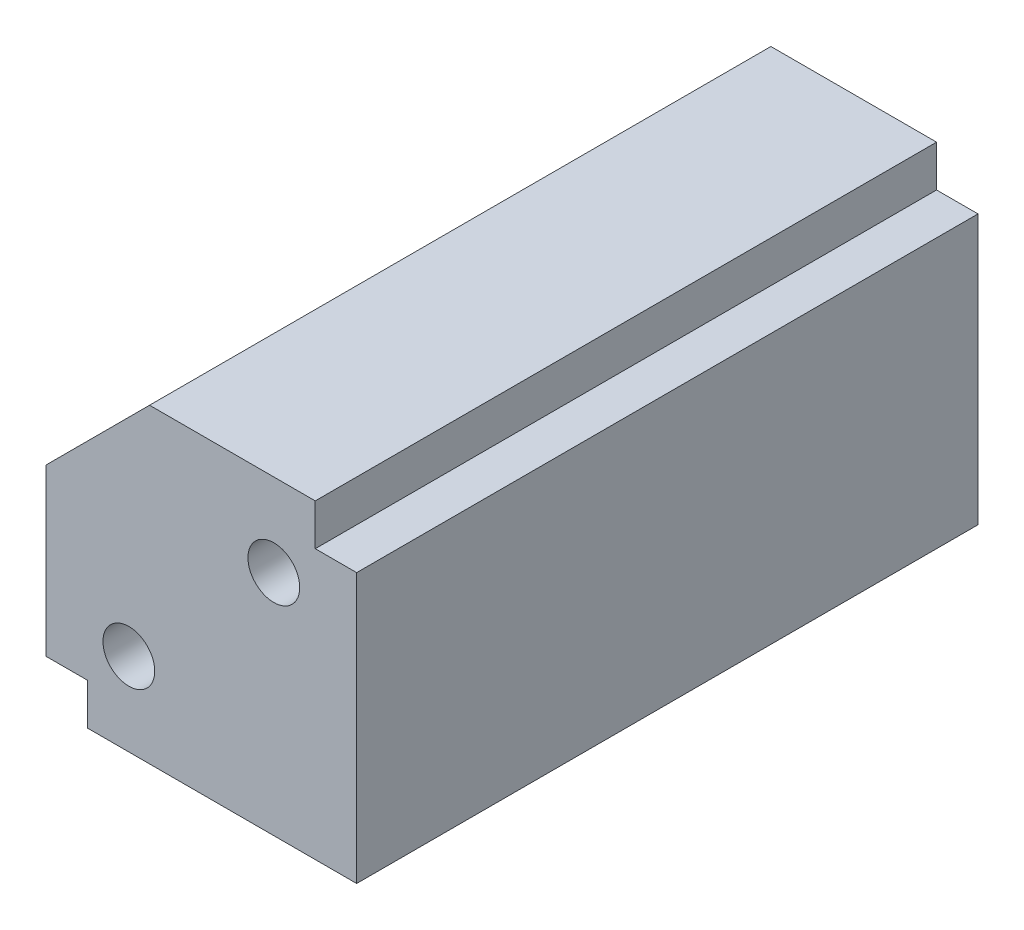
ISO-10303-21;
HEADER;
FILE_DESCRIPTION(('STEP AP214'),'2;1');
FILE_NAME('part.step','',(''),(''),'','','');
FILE_SCHEMA(('AUTOMOTIVE_DESIGN { 1 0 10303 214 1 1 1 1 }'));
ENDSEC;
DATA;
#1=APPLICATION_CONTEXT('core data for automotive mechanical design processes');
#2=APPLICATION_PROTOCOL_DEFINITION('international standard','automotive_design',2000,#1);
#3=PRODUCT_CONTEXT('',#1,'mechanical');
#4=PRODUCT('Part','Part','',(#3));
#5=PRODUCT_RELATED_PRODUCT_CATEGORY('part','',(#4));
#6=PRODUCT_DEFINITION_FORMATION('','',#4);
#7=PRODUCT_DEFINITION_CONTEXT('part definition',#1,'design');
#8=PRODUCT_DEFINITION('design','',#6,#7);
#9=PRODUCT_DEFINITION_SHAPE('','',#8);
#10=(LENGTH_UNIT() NAMED_UNIT(*) SI_UNIT(.MILLI.,.METRE.));
#11=(NAMED_UNIT(*) PLANE_ANGLE_UNIT() SI_UNIT($,.RADIAN.));
#12=(NAMED_UNIT(*) SI_UNIT($,.STERADIAN.) SOLID_ANGLE_UNIT());
#13=UNCERTAINTY_MEASURE_WITH_UNIT(LENGTH_MEASURE(1.E-05),#10,'distance_accuracy_value','');
#14=(GEOMETRIC_REPRESENTATION_CONTEXT(3) GLOBAL_UNCERTAINTY_ASSIGNED_CONTEXT((#13)) GLOBAL_UNIT_ASSIGNED_CONTEXT((#10,
#11,#12)) REPRESENTATION_CONTEXT('',''));
#15=CARTESIAN_POINT('',(0.,0.,0.));
#16=DIRECTION('',(0.,0.,1.));
#17=DIRECTION('',(1.,0.,0.));
#18=AXIS2_PLACEMENT_3D('',#15,#16,#17);
#19=CARTESIAN_POINT('',(-7.5,-7.5,30.));
#20=DIRECTION('',(1.,0.,0.));
#21=DIRECTION('',(0.,0.,-1.));
#22=AXIS2_PLACEMENT_3D('',#19,#20,#21);
#23=PLANE('',#22);
#24=DIRECTION('',(0.,-1.,0.));
#25=VECTOR('',#24,1.);
#26=CARTESIAN_POINT('',(-7.5,-7.5,0.));
#27=LINE('',#26,#25);
#28=CARTESIAN_POINT('',(-7.5,2.5,0.));
#29=VERTEX_POINT('',#28);
#30=CARTESIAN_POINT('',(-7.5,-5.5,0.));
#31=VERTEX_POINT('',#30);
#32=EDGE_CURVE('E146',#29,#31,#27,.T.);
#33=ORIENTED_EDGE('',*,*,#32,.T.);
#34=DIRECTION('',(0.,0.,-1.));
#35=VECTOR('',#34,1.);
#36=CARTESIAN_POINT('',(-7.5,-5.5,0.));
#37=LINE('',#36,#35);
#38=CARTESIAN_POINT('',(-7.5,-5.5,30.));
#39=VERTEX_POINT('',#38);
#40=EDGE_CURVE('E130',#39,#31,#37,.T.);
#41=ORIENTED_EDGE('',*,*,#40,.F.);
#42=DIRECTION('',(0.,-1.,0.));
#43=VECTOR('',#42,1.);
#44=CARTESIAN_POINT('',(-7.5,-7.5,30.));
#45=LINE('',#44,#43);
#46=CARTESIAN_POINT('',(-7.5,2.5,30.));
#47=VERTEX_POINT('',#46);
#48=EDGE_CURVE('E162',#47,#39,#45,.T.);
#49=ORIENTED_EDGE('',*,*,#48,.F.);
#50=DIRECTION('',(0.,0.,-1.));
#51=VECTOR('',#50,1.);
#52=CARTESIAN_POINT('',(-7.5,2.5,30.));
#53=LINE('',#52,#51);
#54=EDGE_CURVE('E166',#47,#29,#53,.T.);
#55=ORIENTED_EDGE('',*,*,#54,.T.);
#56=EDGE_LOOP('',(#33,#41,#49,#55));
#57=FACE_BOUND('',#56,.T.);
#58=ADVANCED_FACE('F40',(#57),#23,.F.);
#59=CARTESIAN_POINT('',(7.5,-7.5,30.));
#60=DIRECTION('',(0.,1.,0.));
#61=DIRECTION('',(-1.,0.,0.));
#62=AXIS2_PLACEMENT_3D('',#59,#60,#61);
#63=PLANE('',#62);
#64=DIRECTION('',(1.,0.,0.));
#65=VECTOR('',#64,1.);
#66=CARTESIAN_POINT('',(7.5,-7.5,30.));
#67=LINE('',#66,#65);
#68=CARTESIAN_POINT('',(-5.5,-7.5,30.));
#69=VERTEX_POINT('',#68);
#70=CARTESIAN_POINT('',(7.5,-7.5,30.));
#71=VERTEX_POINT('',#70);
#72=EDGE_CURVE('E138',#69,#71,#67,.T.);
#73=ORIENTED_EDGE('',*,*,#72,.F.);
#74=DIRECTION('',(0.,0.,1.));
#75=VECTOR('',#74,1.);
#76=CARTESIAN_POINT('',(-5.5,-7.5,0.));
#77=LINE('',#76,#75);
#78=CARTESIAN_POINT('',(-5.5,-7.5,0.));
#79=VERTEX_POINT('',#78);
#80=EDGE_CURVE('E125',#79,#69,#77,.T.);
#81=ORIENTED_EDGE('',*,*,#80,.F.);
#82=DIRECTION('',(1.,0.,0.));
#83=VECTOR('',#82,1.);
#84=CARTESIAN_POINT('',(7.5,-7.5,0.));
#85=LINE('',#84,#83);
#86=CARTESIAN_POINT('',(7.5,-7.5,0.));
#87=VERTEX_POINT('',#86);
#88=EDGE_CURVE('E136',#79,#87,#85,.T.);
#89=ORIENTED_EDGE('',*,*,#88,.T.);
#90=DIRECTION('',(0.,0.,-1.));
#91=VECTOR('',#90,1.);
#92=CARTESIAN_POINT('',(7.5,-7.5,30.));
#93=LINE('',#92,#91);
#94=EDGE_CURVE('E163',#71,#87,#93,.T.);
#95=ORIENTED_EDGE('',*,*,#94,.F.);
#96=EDGE_LOOP('',(#73,#81,#89,#95));
#97=FACE_BOUND('',#96,.T.);
#98=ADVANCED_FACE('F134',(#97),#63,.F.);
#99=CARTESIAN_POINT('',(7.5,-7.5,30.));
#100=DIRECTION('',(-1.,0.,0.));
#101=DIRECTION('',(0.,-1.,0.));
#102=AXIS2_PLACEMENT_3D('',#99,#100,#101);
#103=PLANE('',#102);
#104=DIRECTION('',(0.,1.,0.));
#105=VECTOR('',#104,1.);
#106=CARTESIAN_POINT('',(7.5,-7.5,0.));
#107=LINE('',#106,#105);
#108=CARTESIAN_POINT('',(7.5,5.5,0.));
#109=VERTEX_POINT('',#108);
#110=EDGE_CURVE('E144',#87,#109,#107,.T.);
#111=ORIENTED_EDGE('',*,*,#110,.T.);
#112=DIRECTION('',(0.,0.,-1.));
#113=VECTOR('',#112,1.);
#114=CARTESIAN_POINT('',(7.5,5.5,0.));
#115=LINE('',#114,#113);
#116=CARTESIAN_POINT('',(7.5,5.5,30.));
#117=VERTEX_POINT('',#116);
#118=EDGE_CURVE('E64',#117,#109,#115,.T.);
#119=ORIENTED_EDGE('',*,*,#118,.F.);
#120=DIRECTION('',(0.,1.,0.));
#121=VECTOR('',#120,1.);
#122=CARTESIAN_POINT('',(7.5,-7.5,30.));
#123=LINE('',#122,#121);
#124=EDGE_CURVE('E204',#71,#117,#123,.T.);
#125=ORIENTED_EDGE('',*,*,#124,.F.);
#126=ORIENTED_EDGE('',*,*,#94,.T.);
#127=EDGE_LOOP('',(#111,#119,#125,#126));
#128=FACE_BOUND('',#127,.T.);
#129=ADVANCED_FACE('F331',(#128),#103,.F.);
#130=CARTESIAN_POINT('',(7.5,7.5,30.));
#131=DIRECTION('',(0.,-1.,0.));
#132=DIRECTION('',(1.,0.,0.));
#133=AXIS2_PLACEMENT_3D('',#130,#131,#132);
#134=PLANE('',#133);
#135=DIRECTION('',(-1.,0.,0.));
#136=VECTOR('',#135,1.);
#137=CARTESIAN_POINT('',(7.5,7.5,30.));
#138=LINE('',#137,#136);
#139=CARTESIAN_POINT('',(5.5,7.5,30.));
#140=VERTEX_POINT('',#139);
#141=CARTESIAN_POINT('',(-2.49999999999999,7.5,30.));
#142=VERTEX_POINT('',#141);
#143=EDGE_CURVE('E167',#140,#142,#138,.T.);
#144=ORIENTED_EDGE('',*,*,#143,.F.);
#145=DIRECTION('',(0.,0.,1.));
#146=VECTOR('',#145,1.);
#147=CARTESIAN_POINT('',(5.5,7.5,0.));
#148=LINE('',#147,#146);
#149=CARTESIAN_POINT('',(5.5,7.5,0.));
#150=VERTEX_POINT('',#149);
#151=EDGE_CURVE('E456',#150,#140,#148,.T.);
#152=ORIENTED_EDGE('',*,*,#151,.F.);
#153=DIRECTION('',(-1.,0.,0.));
#154=VECTOR('',#153,1.);
#155=CARTESIAN_POINT('',(7.5,7.5,0.));
#156=LINE('',#155,#154);
#157=CARTESIAN_POINT('',(-2.49999999999999,7.5,0.));
#158=VERTEX_POINT('',#157);
#159=EDGE_CURVE('E152',#150,#158,#156,.T.);
#160=ORIENTED_EDGE('',*,*,#159,.T.);
#161=DIRECTION('',(0.,0.,1.));
#162=VECTOR('',#161,1.);
#163=CARTESIAN_POINT('',(-2.49999999999999,7.5,30.));
#164=LINE('',#163,#162);
#165=EDGE_CURVE('E49',#158,#142,#164,.T.);
#166=ORIENTED_EDGE('',*,*,#165,.T.);
#167=EDGE_LOOP('',(#144,#152,#160,#166));
#168=FACE_BOUND('',#167,.T.);
#169=ADVANCED_FACE('F183',(#168),#134,.F.);
#170=CARTESIAN_POINT('',(0.,0.,30.));
#171=DIRECTION('',(0.,0.,1.));
#172=DIRECTION('',(1.,0.,0.));
#173=AXIS2_PLACEMENT_3D('',#170,#171,#172);
#174=PLANE('',#173);
#175=DIRECTION('',(-1.,0.,0.));
#176=VECTOR('',#175,1.);
#177=CARTESIAN_POINT('',(-5.5,-5.5,30.));
#178=LINE('',#177,#176);
#179=CARTESIAN_POINT('',(-5.5,-5.5,30.));
#180=VERTEX_POINT('',#179);
#181=EDGE_CURVE('E457',#180,#39,#178,.T.);
#182=ORIENTED_EDGE('',*,*,#181,.F.);
#183=DIRECTION('',(0.,1.,0.));
#184=VECTOR('',#183,1.);
#185=CARTESIAN_POINT('',(-5.5,-7.5,30.));
#186=LINE('',#185,#184);
#187=EDGE_CURVE('E139',#69,#180,#186,.T.);
#188=ORIENTED_EDGE('',*,*,#187,.F.);
#189=ORIENTED_EDGE('',*,*,#72,.T.);
#190=ORIENTED_EDGE('',*,*,#124,.T.);
#191=DIRECTION('',(1.,0.,0.));
#192=VECTOR('',#191,1.);
#193=CARTESIAN_POINT('',(7.5,5.5,30.));
#194=LINE('',#193,#192);
#195=CARTESIAN_POINT('',(5.5,5.5,30.));
#196=VERTEX_POINT('',#195);
#197=EDGE_CURVE('E478',#196,#117,#194,.T.);
#198=ORIENTED_EDGE('',*,*,#197,.F.);
#199=DIRECTION('',(0.,1.,0.));
#200=VECTOR('',#199,1.);
#201=CARTESIAN_POINT('',(5.5,5.5,30.));
#202=LINE('',#201,#200);
#203=EDGE_CURVE('E283',#196,#140,#202,.T.);
#204=ORIENTED_EDGE('',*,*,#203,.T.);
#205=ORIENTED_EDGE('',*,*,#143,.T.);
#206=DIRECTION('',(0.707106781186548,0.707106781186547,0.));
#207=VECTOR('',#206,1.);
#208=CARTESIAN_POINT('',(-4.99999999999999,5.,30.));
#209=LINE('',#208,#207);
#210=EDGE_CURVE('E11',#142,#47,#209,.F.);
#211=ORIENTED_EDGE('',*,*,#210,.T.);
#212=ORIENTED_EDGE('',*,*,#48,.T.);
#213=EDGE_LOOP('',(#182,#188,#189,#190,#198,#204,#205,#211,#212));
#214=FACE_BOUND('',#213,.T.);
#215=CARTESIAN_POINT('',(-3.5,-3.5,30.));
#216=DIRECTION('',(0.,0.,1.));
#217=DIRECTION('',(1.,0.,0.));
#218=AXIS2_PLACEMENT_3D('',#215,#216,#217);
#219=CIRCLE('',#218,1.25);
#220=CARTESIAN_POINT('',(-2.25,-3.5,30.));
#221=VERTEX_POINT('',#220);
#222=EDGE_CURVE('E267',#221,#221,#219,.T.);
#223=ORIENTED_EDGE('',*,*,#222,.F.);
#224=EDGE_LOOP('',(#223));
#225=FACE_BOUND('',#224,.T.);
#226=CARTESIAN_POINT('',(3.5,3.5,30.));
#227=DIRECTION('',(0.,0.,1.));
#228=DIRECTION('',(1.,0.,0.));
#229=AXIS2_PLACEMENT_3D('',#226,#227,#228);
#230=CIRCLE('',#229,1.25);
#231=CARTESIAN_POINT('',(4.75,3.5,30.));
#232=VERTEX_POINT('',#231);
#233=EDGE_CURVE('E301',#232,#232,#230,.T.);
#234=ORIENTED_EDGE('',*,*,#233,.F.);
#235=EDGE_LOOP('',(#234));
#236=FACE_BOUND('',#235,.T.);
#237=ADVANCED_FACE('F192',(#214,#225,#236),#174,.T.);
#238=CARTESIAN_POINT('',(0.,0.,0.));
#239=DIRECTION('',(0.,0.,1.));
#240=DIRECTION('',(1.,0.,0.));
#241=AXIS2_PLACEMENT_3D('',#238,#239,#240);
#242=PLANE('',#241);
#243=CARTESIAN_POINT('',(-3.5,-3.5,0.));
#244=DIRECTION('',(0.,0.,-1.));
#245=DIRECTION('',(-1.,0.,0.));
#246=AXIS2_PLACEMENT_3D('',#243,#244,#245);
#247=CIRCLE('',#246,1.25);
#248=CARTESIAN_POINT('',(-4.75,-3.5,0.));
#249=VERTEX_POINT('',#248);
#250=EDGE_CURVE('E280',#249,#249,#247,.T.);
#251=ORIENTED_EDGE('',*,*,#250,.F.);
#252=EDGE_LOOP('',(#251));
#253=FACE_BOUND('',#252,.T.);
#254=CARTESIAN_POINT('',(3.5,3.5,0.));
#255=DIRECTION('',(0.,0.,-1.));
#256=DIRECTION('',(-1.,0.,0.));
#257=AXIS2_PLACEMENT_3D('',#254,#255,#256);
#258=CIRCLE('',#257,1.25);
#259=CARTESIAN_POINT('',(2.25,3.5,0.));
#260=VERTEX_POINT('',#259);
#261=EDGE_CURVE('E268',#260,#260,#258,.T.);
#262=ORIENTED_EDGE('',*,*,#261,.F.);
#263=EDGE_LOOP('',(#262));
#264=FACE_BOUND('',#263,.T.);
#265=DIRECTION('',(0.,-1.,0.));
#266=VECTOR('',#265,1.);
#267=CARTESIAN_POINT('',(-5.5,-7.5,0.));
#268=LINE('',#267,#266);
#269=CARTESIAN_POINT('',(-5.5,-5.5,0.));
#270=VERTEX_POINT('',#269);
#271=EDGE_CURVE('E122',#270,#79,#268,.T.);
#272=ORIENTED_EDGE('',*,*,#271,.F.);
#273=DIRECTION('',(-1.,0.,0.));
#274=VECTOR('',#273,1.);
#275=CARTESIAN_POINT('',(-5.5,-5.5,0.));
#276=LINE('',#275,#274);
#277=EDGE_CURVE('E453',#270,#31,#276,.T.);
#278=ORIENTED_EDGE('',*,*,#277,.T.);
#279=ORIENTED_EDGE('',*,*,#32,.F.);
#280=DIRECTION('',(-0.707106781186548,-0.707106781186547,0.));
#281=VECTOR('',#280,1.);
#282=CARTESIAN_POINT('',(-7.5,2.5,0.));
#283=LINE('',#282,#281);
#284=EDGE_CURVE('E171',#29,#158,#283,.F.);
#285=ORIENTED_EDGE('',*,*,#284,.T.);
#286=ORIENTED_EDGE('',*,*,#159,.F.);
#287=DIRECTION('',(0.,1.,0.));
#288=VECTOR('',#287,1.);
#289=CARTESIAN_POINT('',(5.5,5.5,0.));
#290=LINE('',#289,#288);
#291=CARTESIAN_POINT('',(5.5,5.5,0.));
#292=VERTEX_POINT('',#291);
#293=EDGE_CURVE('E291',#292,#150,#290,.T.);
#294=ORIENTED_EDGE('',*,*,#293,.F.);
#295=DIRECTION('',(-1.,0.,0.));
#296=VECTOR('',#295,1.);
#297=CARTESIAN_POINT('',(7.5,5.5,0.));
#298=LINE('',#297,#296);
#299=EDGE_CURVE('E470',#109,#292,#298,.T.);
#300=ORIENTED_EDGE('',*,*,#299,.F.);
#301=ORIENTED_EDGE('',*,*,#110,.F.);
#302=ORIENTED_EDGE('',*,*,#88,.F.);
#303=EDGE_LOOP('',(#272,#278,#279,#285,#286,#294,#300,#301,#302));
#304=FACE_BOUND('',#303,.T.);
#305=ADVANCED_FACE('F142',(#253,#264,#304),#242,.F.);
#306=CARTESIAN_POINT('',(-7.5,2.5,30.));
#307=DIRECTION('',(0.707106781186547,-0.707106781186548,0.));
#308=DIRECTION('',(0.,0.,-1.));
#309=AXIS2_PLACEMENT_3D('',#306,#307,#308);
#310=PLANE('',#309);
#311=ORIENTED_EDGE('',*,*,#210,.F.);
#312=ORIENTED_EDGE('',*,*,#165,.F.);
#313=ORIENTED_EDGE('',*,*,#284,.F.);
#314=ORIENTED_EDGE('',*,*,#54,.F.);
#315=EDGE_LOOP('',(#311,#312,#313,#314));
#316=FACE_BOUND('',#315,.T.);
#317=ADVANCED_FACE('F42',(#316),#310,.F.);
#318=CARTESIAN_POINT('',(3.5,3.5,22.5));
#319=DIRECTION('',(0.,0.,1.));
#320=DIRECTION('',(1.,0.,0.));
#321=AXIS2_PLACEMENT_3D('',#318,#319,#320);
#322=CONICAL_SURFACE('',#321,1.25,1.02974425867665);
#323=CARTESIAN_POINT('',(3.5,3.5,21.7489242262155));
#324=VERTEX_POINT('',#323);
#325=VERTEX_LOOP('',#324);
#326=FACE_BOUND('',#325,.T.);
#327=CARTESIAN_POINT('',(3.5,3.5,22.5));
#328=DIRECTION('',(0.,0.,1.));
#329=DIRECTION('',(1.,0.,0.));
#330=AXIS2_PLACEMENT_3D('',#327,#328,#329);
#331=CIRCLE('',#330,1.25);
#332=CARTESIAN_POINT('',(4.75,3.5,22.5));
#333=VERTEX_POINT('',#332);
#334=EDGE_CURVE('E156',#333,#333,#331,.T.);
#335=ORIENTED_EDGE('',*,*,#334,.T.);
#336=EDGE_LOOP('',(#335));
#337=FACE_BOUND('',#336,.T.);
#338=ADVANCED_FACE('F314',(#326,#337),#322,.F.);
#339=CARTESIAN_POINT('',(3.5,3.5,30.));
#340=DIRECTION('',(0.,0.,1.));
#341=DIRECTION('',(1.,0.,0.));
#342=AXIS2_PLACEMENT_3D('',#339,#340,#341);
#343=CYLINDRICAL_SURFACE('',#342,1.25);
#344=ORIENTED_EDGE('',*,*,#334,.F.);
#345=EDGE_LOOP('',(#344));
#346=FACE_BOUND('',#345,.T.);
#347=ORIENTED_EDGE('',*,*,#233,.T.);
#348=EDGE_LOOP('',(#347));
#349=FACE_BOUND('',#348,.T.);
#350=ADVANCED_FACE('F316',(#346,#349),#343,.F.);
#351=CARTESIAN_POINT('',(-3.5,-3.5,22.5));
#352=DIRECTION('',(0.,0.,1.));
#353=DIRECTION('',(1.,0.,0.));
#354=AXIS2_PLACEMENT_3D('',#351,#352,#353);
#355=CONICAL_SURFACE('',#354,1.25,1.02974425867665);
#356=CARTESIAN_POINT('',(-3.5,-3.5,21.7489242262155));
#357=VERTEX_POINT('',#356);
#358=VERTEX_LOOP('',#357);
#359=FACE_BOUND('',#358,.T.);
#360=CARTESIAN_POINT('',(-3.5,-3.5,22.5));
#361=DIRECTION('',(0.,0.,1.));
#362=DIRECTION('',(1.,0.,0.));
#363=AXIS2_PLACEMENT_3D('',#360,#361,#362);
#364=CIRCLE('',#363,1.25);
#365=CARTESIAN_POINT('',(-2.25,-3.5,22.5));
#366=VERTEX_POINT('',#365);
#367=EDGE_CURVE('E298',#366,#366,#364,.T.);
#368=ORIENTED_EDGE('',*,*,#367,.T.);
#369=EDGE_LOOP('',(#368));
#370=FACE_BOUND('',#369,.T.);
#371=ADVANCED_FACE('F318',(#359,#370),#355,.F.);
#372=CARTESIAN_POINT('',(-3.5,-3.5,30.));
#373=DIRECTION('',(0.,0.,1.));
#374=DIRECTION('',(1.,0.,0.));
#375=AXIS2_PLACEMENT_3D('',#372,#373,#374);
#376=CYLINDRICAL_SURFACE('',#375,1.25);
#377=ORIENTED_EDGE('',*,*,#367,.F.);
#378=EDGE_LOOP('',(#377));
#379=FACE_BOUND('',#378,.T.);
#380=ORIENTED_EDGE('',*,*,#222,.T.);
#381=EDGE_LOOP('',(#380));
#382=FACE_BOUND('',#381,.T.);
#383=ADVANCED_FACE('F247',(#379,#382),#376,.F.);
#384=CARTESIAN_POINT('',(3.5,3.5,7.5));
#385=DIRECTION('',(0.,0.,-1.));
#386=DIRECTION('',(-1.,0.,0.));
#387=AXIS2_PLACEMENT_3D('',#384,#385,#386);
#388=CONICAL_SURFACE('',#387,1.25,1.02974425867665);
#389=CARTESIAN_POINT('',(3.5,3.5,8.25107577378445));
#390=VERTEX_POINT('',#389);
#391=VERTEX_LOOP('',#390);
#392=FACE_BOUND('',#391,.T.);
#393=CARTESIAN_POINT('',(3.5,3.5,7.5));
#394=DIRECTION('',(0.,0.,-1.));
#395=DIRECTION('',(-1.,0.,0.));
#396=AXIS2_PLACEMENT_3D('',#393,#394,#395);
#397=CIRCLE('',#396,1.25);
#398=CARTESIAN_POINT('',(2.25,3.5,7.5));
#399=VERTEX_POINT('',#398);
#400=EDGE_CURVE('E264',#399,#399,#397,.T.);
#401=ORIENTED_EDGE('',*,*,#400,.T.);
#402=EDGE_LOOP('',(#401));
#403=FACE_BOUND('',#402,.T.);
#404=ADVANCED_FACE('F242',(#392,#403),#388,.F.);
#405=CARTESIAN_POINT('',(3.5,3.5,0.));
#406=DIRECTION('',(0.,0.,-1.));
#407=DIRECTION('',(-1.,0.,0.));
#408=AXIS2_PLACEMENT_3D('',#405,#406,#407);
#409=CYLINDRICAL_SURFACE('',#408,1.25);
#410=ORIENTED_EDGE('',*,*,#400,.F.);
#411=EDGE_LOOP('',(#410));
#412=FACE_BOUND('',#411,.T.);
#413=ORIENTED_EDGE('',*,*,#261,.T.);
#414=EDGE_LOOP('',(#413));
#415=FACE_BOUND('',#414,.T.);
#416=ADVANCED_FACE('F234',(#412,#415),#409,.F.);
#417=CARTESIAN_POINT('',(-3.5,-3.5,7.5));
#418=DIRECTION('',(0.,0.,-1.));
#419=DIRECTION('',(-1.,0.,0.));
#420=AXIS2_PLACEMENT_3D('',#417,#418,#419);
#421=CONICAL_SURFACE('',#420,1.25,1.02974425867665);
#422=CARTESIAN_POINT('',(-3.5,-3.5,8.25107577378445));
#423=VERTEX_POINT('',#422);
#424=VERTEX_LOOP('',#423);
#425=FACE_BOUND('',#424,.T.);
#426=CARTESIAN_POINT('',(-3.5,-3.5,7.5));
#427=DIRECTION('',(0.,0.,-1.));
#428=DIRECTION('',(-1.,0.,0.));
#429=AXIS2_PLACEMENT_3D('',#426,#427,#428);
#430=CIRCLE('',#429,1.25);
#431=CARTESIAN_POINT('',(-4.75,-3.5,7.5));
#432=VERTEX_POINT('',#431);
#433=EDGE_CURVE('E276',#432,#432,#430,.T.);
#434=ORIENTED_EDGE('',*,*,#433,.T.);
#435=EDGE_LOOP('',(#434));
#436=FACE_BOUND('',#435,.T.);
#437=ADVANCED_FACE('F222',(#425,#436),#421,.F.);
#438=CARTESIAN_POINT('',(-3.5,-3.5,0.));
#439=DIRECTION('',(0.,0.,-1.));
#440=DIRECTION('',(-1.,0.,0.));
#441=AXIS2_PLACEMENT_3D('',#438,#439,#440);
#442=CYLINDRICAL_SURFACE('',#441,1.25);
#443=ORIENTED_EDGE('',*,*,#433,.F.);
#444=EDGE_LOOP('',(#443));
#445=FACE_BOUND('',#444,.T.);
#446=ORIENTED_EDGE('',*,*,#250,.T.);
#447=EDGE_LOOP('',(#446));
#448=FACE_BOUND('',#447,.T.);
#449=ADVANCED_FACE('F215',(#445,#448),#442,.F.);
#450=CARTESIAN_POINT('',(5.5,5.5,0.));
#451=DIRECTION('',(-1.,0.,0.));
#452=DIRECTION('',(0.,0.,1.));
#453=AXIS2_PLACEMENT_3D('',#450,#451,#452);
#454=PLANE('',#453);
#455=ORIENTED_EDGE('',*,*,#151,.T.);
#456=ORIENTED_EDGE('',*,*,#203,.F.);
#457=DIRECTION('',(0.,0.,1.));
#458=VECTOR('',#457,1.);
#459=CARTESIAN_POINT('',(5.5,5.5,0.));
#460=LINE('',#459,#458);
#461=EDGE_CURVE('E472',#292,#196,#460,.T.);
#462=ORIENTED_EDGE('',*,*,#461,.F.);
#463=ORIENTED_EDGE('',*,*,#293,.T.);
#464=EDGE_LOOP('',(#455,#456,#462,#463));
#465=FACE_BOUND('',#464,.T.);
#466=ADVANCED_FACE('F221',(#465),#454,.F.);
#467=CARTESIAN_POINT('',(0.,5.5,0.));
#468=DIRECTION('',(0.,-1.,0.));
#469=DIRECTION('',(0.,0.,-1.));
#470=AXIS2_PLACEMENT_3D('',#467,#468,#469);
#471=PLANE('',#470);
#472=ORIENTED_EDGE('',*,*,#118,.T.);
#473=ORIENTED_EDGE('',*,*,#299,.T.);
#474=ORIENTED_EDGE('',*,*,#461,.T.);
#475=ORIENTED_EDGE('',*,*,#197,.T.);
#476=EDGE_LOOP('',(#472,#473,#474,#475));
#477=FACE_BOUND('',#476,.T.);
#478=ADVANCED_FACE('F421',(#477),#471,.F.);
#479=CARTESIAN_POINT('',(-5.5,-5.5,0.));
#480=DIRECTION('',(0.,1.,0.));
#481=DIRECTION('',(0.,0.,1.));
#482=AXIS2_PLACEMENT_3D('',#479,#480,#481);
#483=PLANE('',#482);
#484=ORIENTED_EDGE('',*,*,#40,.T.);
#485=ORIENTED_EDGE('',*,*,#277,.F.);
#486=DIRECTION('',(0.,0.,-1.));
#487=VECTOR('',#486,1.);
#488=CARTESIAN_POINT('',(-5.5,-5.5,0.));
#489=LINE('',#488,#487);
#490=EDGE_CURVE('E56',#180,#270,#489,.T.);
#491=ORIENTED_EDGE('',*,*,#490,.F.);
#492=ORIENTED_EDGE('',*,*,#181,.T.);
#493=EDGE_LOOP('',(#484,#485,#491,#492));
#494=FACE_BOUND('',#493,.T.);
#495=ADVANCED_FACE('F430',(#494),#483,.F.);
#496=CARTESIAN_POINT('',(-5.5,0.,0.));
#497=DIRECTION('',(1.,0.,0.));
#498=DIRECTION('',(0.,0.,-1.));
#499=AXIS2_PLACEMENT_3D('',#496,#497,#498);
#500=PLANE('',#499);
#501=ORIENTED_EDGE('',*,*,#271,.T.);
#502=ORIENTED_EDGE('',*,*,#80,.T.);
#503=ORIENTED_EDGE('',*,*,#187,.T.);
#504=ORIENTED_EDGE('',*,*,#490,.T.);
#505=EDGE_LOOP('',(#501,#502,#503,#504));
#506=FACE_BOUND('',#505,.T.);
#507=ADVANCED_FACE('F124',(#506),#500,.F.);
#508=CLOSED_SHELL('',(#58,#98,#129,#169,#237,#305,#317,#338,#350,#371,#383,#404,#416,#437,#449,
#466,#478,#495,#507));
#509=MANIFOLD_SOLID_BREP('B2',#508);
#510=ADVANCED_BREP_SHAPE_REPRESENTATION('',(#18,#509),#14);
#511=SHAPE_DEFINITION_REPRESENTATION(#9,#510);
ENDSEC;
END-ISO-10303-21;
